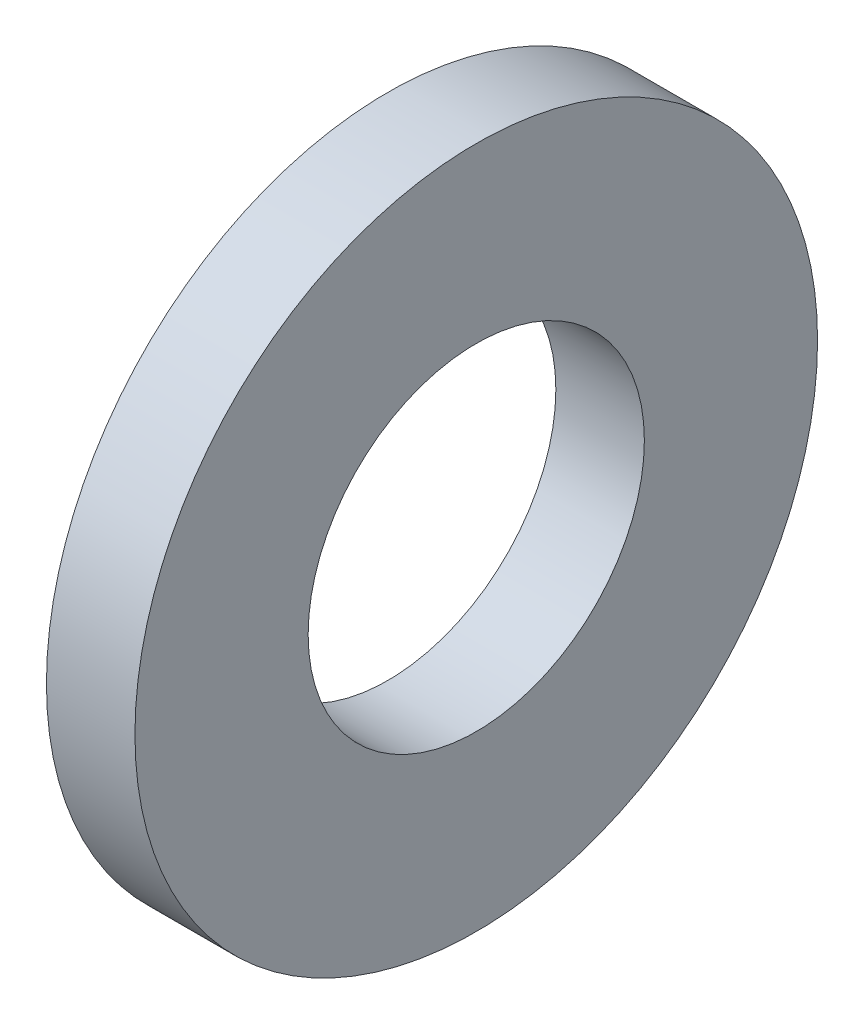
ISO-10303-21;
HEADER;
FILE_DESCRIPTION(('STEP AP214'),'2;1');
FILE_NAME('part.step','',(''),(''),'','','');
FILE_SCHEMA(('AUTOMOTIVE_DESIGN { 1 0 10303 214 1 1 1 1 }'));
ENDSEC;
DATA;
#1=APPLICATION_CONTEXT('core data for automotive mechanical design processes');
#2=APPLICATION_PROTOCOL_DEFINITION('international standard','automotive_design',2000,#1);
#3=PRODUCT_CONTEXT('',#1,'mechanical');
#4=PRODUCT('Part','Part','',(#3));
#5=PRODUCT_RELATED_PRODUCT_CATEGORY('part','',(#4));
#6=PRODUCT_DEFINITION_FORMATION('','',#4);
#7=PRODUCT_DEFINITION_CONTEXT('part definition',#1,'design');
#8=PRODUCT_DEFINITION('design','',#6,#7);
#9=PRODUCT_DEFINITION_SHAPE('','',#8);
#10=(LENGTH_UNIT() NAMED_UNIT(*) SI_UNIT(.MILLI.,.METRE.));
#11=(NAMED_UNIT(*) PLANE_ANGLE_UNIT() SI_UNIT($,.RADIAN.));
#12=(NAMED_UNIT(*) SI_UNIT($,.STERADIAN.) SOLID_ANGLE_UNIT());
#13=UNCERTAINTY_MEASURE_WITH_UNIT(LENGTH_MEASURE(1.E-05),#10,'distance_accuracy_value','');
#14=(GEOMETRIC_REPRESENTATION_CONTEXT(3) GLOBAL_UNCERTAINTY_ASSIGNED_CONTEXT((#13)) GLOBAL_UNIT_ASSIGNED_CONTEXT((#10,
#11,#12)) REPRESENTATION_CONTEXT('',''));
#15=CARTESIAN_POINT('',(0.,0.,0.));
#16=DIRECTION('',(0.,0.,1.));
#17=DIRECTION('',(1.,0.,0.));
#18=AXIS2_PLACEMENT_3D('',#15,#16,#17);
#19=CARTESIAN_POINT('',(4.4196,0.,0.));
#20=DIRECTION('',(1.,0.,0.));
#21=DIRECTION('',(0.,0.,-1.));
#22=AXIS2_PLACEMENT_3D('',#19,#20,#21);
#23=PLANE('',#22);
#24=CARTESIAN_POINT('',(4.4196,0.,0.));
#25=DIRECTION('',(1.,0.,0.));
#26=DIRECTION('',(0.,0.,-1.));
#27=AXIS2_PLACEMENT_3D('',#24,#25,#26);
#28=CIRCLE('',#27,17.0434);
#29=CARTESIAN_POINT('',(4.4196,0.,-17.0434));
#30=VERTEX_POINT('',#29);
#31=EDGE_CURVE('E10',#30,#30,#28,.T.);
#32=ORIENTED_EDGE('',*,*,#31,.T.);
#33=EDGE_LOOP('',(#32));
#34=FACE_BOUND('',#33,.T.);
#35=CARTESIAN_POINT('',(4.4196,0.,0.));
#36=DIRECTION('',(1.,0.,0.));
#37=DIRECTION('',(0.,0.,-1.));
#38=AXIS2_PLACEMENT_3D('',#35,#36,#37);
#39=CIRCLE('',#38,8.3947);
#40=CARTESIAN_POINT('',(4.4196,0.,-8.3947));
#41=VERTEX_POINT('',#40);
#42=EDGE_CURVE('E46',#41,#41,#39,.T.);
#43=ORIENTED_EDGE('',*,*,#42,.F.);
#44=EDGE_LOOP('',(#43));
#45=FACE_BOUND('',#44,.T.);
#46=ADVANCED_FACE('F35',(#34,#45),#23,.T.);
#47=CARTESIAN_POINT('',(0.,0.,0.));
#48=DIRECTION('',(1.,0.,0.));
#49=DIRECTION('',(0.,0.,-1.));
#50=AXIS2_PLACEMENT_3D('',#47,#48,#49);
#51=PLANE('',#50);
#52=CARTESIAN_POINT('',(0.,0.,0.));
#53=DIRECTION('',(1.,0.,0.));
#54=DIRECTION('',(0.,0.,-1.));
#55=AXIS2_PLACEMENT_3D('',#52,#53,#54);
#56=CIRCLE('',#55,17.0434);
#57=CARTESIAN_POINT('',(0.,0.,-17.0434));
#58=VERTEX_POINT('',#57);
#59=EDGE_CURVE('E39',#58,#58,#56,.T.);
#60=ORIENTED_EDGE('',*,*,#59,.F.);
#61=EDGE_LOOP('',(#60));
#62=FACE_BOUND('',#61,.T.);
#63=CARTESIAN_POINT('',(0.,0.,0.));
#64=DIRECTION('',(1.,0.,0.));
#65=DIRECTION('',(0.,0.,-1.));
#66=AXIS2_PLACEMENT_3D('',#63,#64,#65);
#67=CIRCLE('',#66,8.3947);
#68=CARTESIAN_POINT('',(0.,0.,-8.3947));
#69=VERTEX_POINT('',#68);
#70=EDGE_CURVE('E48',#69,#69,#67,.T.);
#71=ORIENTED_EDGE('',*,*,#70,.T.);
#72=EDGE_LOOP('',(#71));
#73=FACE_BOUND('',#72,.T.);
#74=ADVANCED_FACE('F58',(#62,#73),#51,.F.);
#75=CARTESIAN_POINT('',(4.4196,0.,0.));
#76=DIRECTION('',(-1.,0.,0.));
#77=DIRECTION('',(0.,0.,1.));
#78=AXIS2_PLACEMENT_3D('',#75,#76,#77);
#79=CYLINDRICAL_SURFACE('',#78,17.0434);
#80=ORIENTED_EDGE('',*,*,#31,.F.);
#81=EDGE_LOOP('',(#80));
#82=FACE_BOUND('',#81,.T.);
#83=ORIENTED_EDGE('',*,*,#59,.T.);
#84=EDGE_LOOP('',(#83));
#85=FACE_BOUND('',#84,.T.);
#86=ADVANCED_FACE('F37',(#82,#85),#79,.T.);
#87=CARTESIAN_POINT('',(4.4196,0.,0.));
#88=DIRECTION('',(-1.,0.,0.));
#89=DIRECTION('',(0.,0.,1.));
#90=AXIS2_PLACEMENT_3D('',#87,#88,#89);
#91=CYLINDRICAL_SURFACE('',#90,8.3947);
#92=ORIENTED_EDGE('',*,*,#42,.T.);
#93=EDGE_LOOP('',(#92));
#94=FACE_BOUND('',#93,.T.);
#95=ORIENTED_EDGE('',*,*,#70,.F.);
#96=EDGE_LOOP('',(#95));
#97=FACE_BOUND('',#96,.T.);
#98=ADVANCED_FACE('F54',(#94,#97),#91,.F.);
#99=CLOSED_SHELL('',(#46,#74,#86,#98));
#100=MANIFOLD_SOLID_BREP('B2',#99);
#101=ADVANCED_BREP_SHAPE_REPRESENTATION('',(#18,#100),#14);
#102=SHAPE_DEFINITION_REPRESENTATION(#9,#101);
ENDSEC;
END-ISO-10303-21;
